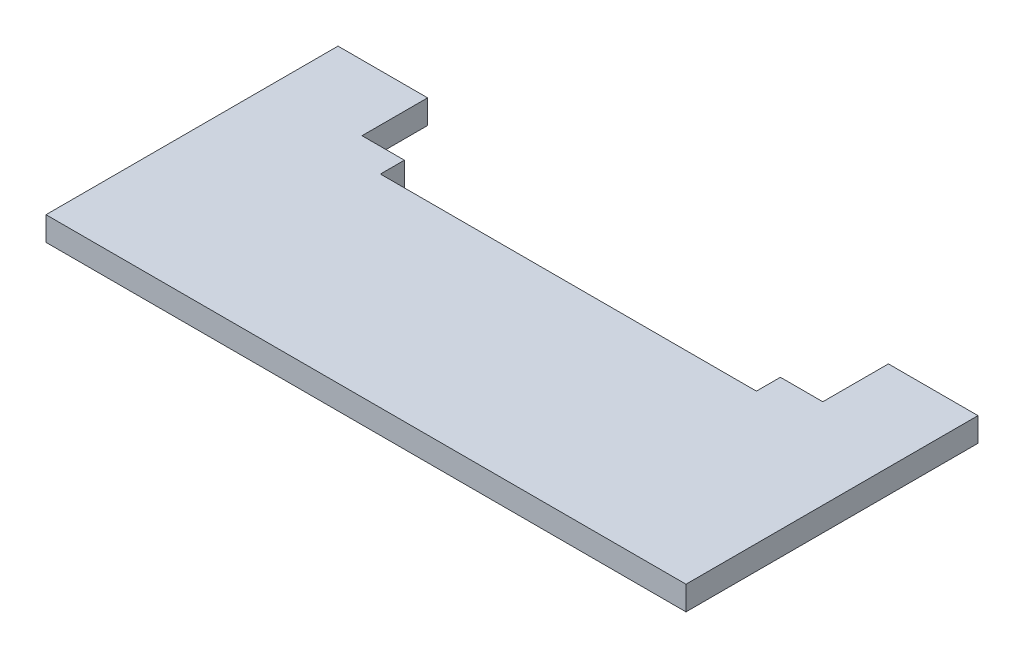
ISO-10303-21;
HEADER;
FILE_DESCRIPTION(('STEP AP214'),'2;1');
FILE_NAME('part.step','',(''),(''),'','','');
FILE_SCHEMA(('AUTOMOTIVE_DESIGN { 1 0 10303 214 1 1 1 1 }'));
ENDSEC;
DATA;
#1=APPLICATION_CONTEXT('core data for automotive mechanical design processes');
#2=APPLICATION_PROTOCOL_DEFINITION('international standard','automotive_design',2000,#1);
#3=PRODUCT_CONTEXT('',#1,'mechanical');
#4=PRODUCT('Part','Part','',(#3));
#5=PRODUCT_RELATED_PRODUCT_CATEGORY('part','',(#4));
#6=PRODUCT_DEFINITION_FORMATION('','',#4);
#7=PRODUCT_DEFINITION_CONTEXT('part definition',#1,'design');
#8=PRODUCT_DEFINITION('design','',#6,#7);
#9=PRODUCT_DEFINITION_SHAPE('','',#8);
#10=(LENGTH_UNIT() NAMED_UNIT(*) SI_UNIT(.MILLI.,.METRE.));
#11=(NAMED_UNIT(*) PLANE_ANGLE_UNIT() SI_UNIT($,.RADIAN.));
#12=(NAMED_UNIT(*) SI_UNIT($,.STERADIAN.) SOLID_ANGLE_UNIT());
#13=UNCERTAINTY_MEASURE_WITH_UNIT(LENGTH_MEASURE(1.E-05),#10,'distance_accuracy_value','');
#14=(GEOMETRIC_REPRESENTATION_CONTEXT(3) GLOBAL_UNCERTAINTY_ASSIGNED_CONTEXT((#13)) GLOBAL_UNIT_ASSIGNED_CONTEXT((#10,
#11,#12)) REPRESENTATION_CONTEXT('',''));
#15=CARTESIAN_POINT('',(0.,0.,0.));
#16=DIRECTION('',(0.,0.,1.));
#17=DIRECTION('',(1.,0.,0.));
#18=AXIS2_PLACEMENT_3D('',#15,#16,#17);
#19=CARTESIAN_POINT('',(11.2,-3.00000000000002,0.));
#20=DIRECTION('',(0.,0.,-1.));
#21=DIRECTION('',(-1.,0.,0.));
#22=AXIS2_PLACEMENT_3D('',#19,#20,#21);
#23=PLANE('',#22);
#24=DIRECTION('',(-1.,0.,0.));
#25=VECTOR('',#24,1.);
#26=CARTESIAN_POINT('',(11.2,0.,0.));
#27=LINE('',#26,#25);
#28=CARTESIAN_POINT('',(11.2,0.,0.));
#29=VERTEX_POINT('',#28);
#30=CARTESIAN_POINT('',(0.,0.,0.));
#31=VERTEX_POINT('',#30);
#32=EDGE_CURVE('E154',#29,#31,#27,.T.);
#33=ORIENTED_EDGE('',*,*,#32,.F.);
#34=DIRECTION('',(0.,1.,0.));
#35=VECTOR('',#34,1.);
#36=CARTESIAN_POINT('',(11.2,-3.00000000000002,0.));
#37=LINE('',#36,#35);
#38=CARTESIAN_POINT('',(11.2,-3.00000000000002,0.));
#39=VERTEX_POINT('',#38);
#40=EDGE_CURVE('E11',#39,#29,#37,.T.);
#41=ORIENTED_EDGE('',*,*,#40,.F.);
#42=DIRECTION('',(-1.,0.,0.));
#43=VECTOR('',#42,1.);
#44=CARTESIAN_POINT('',(11.2,-3.00000000000002,0.));
#45=LINE('',#44,#43);
#46=CARTESIAN_POINT('',(0.,-3.00000000000002,0.));
#47=VERTEX_POINT('',#46);
#48=EDGE_CURVE('E186',#39,#47,#45,.T.);
#49=ORIENTED_EDGE('',*,*,#48,.T.);
#50=DIRECTION('',(0.,1.,0.));
#51=VECTOR('',#50,1.);
#52=CARTESIAN_POINT('',(0.,-3.00000000000002,0.));
#53=LINE('',#52,#51);
#54=EDGE_CURVE('E36',#47,#31,#53,.T.);
#55=ORIENTED_EDGE('',*,*,#54,.T.);
#56=EDGE_LOOP('',(#33,#41,#49,#55));
#57=FACE_BOUND('',#56,.T.);
#58=ADVANCED_FACE('F33',(#57),#23,.T.);
#59=CARTESIAN_POINT('',(11.2,-3.00000000000002,0.));
#60=DIRECTION('',(1.,0.,0.));
#61=DIRECTION('',(0.,0.,-1.));
#62=AXIS2_PLACEMENT_3D('',#59,#60,#61);
#63=PLANE('',#62);
#64=DIRECTION('',(0.,0.,-1.));
#65=VECTOR('',#64,1.);
#66=CARTESIAN_POINT('',(11.2,0.,0.));
#67=LINE('',#66,#65);
#68=CARTESIAN_POINT('',(11.2,0.,8.19999999999996));
#69=VERTEX_POINT('',#68);
#70=EDGE_CURVE('E184',#69,#29,#67,.T.);
#71=ORIENTED_EDGE('',*,*,#70,.F.);
#72=DIRECTION('',(0.,1.,0.));
#73=VECTOR('',#72,1.);
#74=CARTESIAN_POINT('',(11.2,-3.00000000000002,8.19999999999996));
#75=LINE('',#74,#73);
#76=CARTESIAN_POINT('',(11.2,-3.00000000000002,8.19999999999996));
#77=VERTEX_POINT('',#76);
#78=EDGE_CURVE('E42',#77,#69,#75,.T.);
#79=ORIENTED_EDGE('',*,*,#78,.F.);
#80=DIRECTION('',(0.,0.,-1.));
#81=VECTOR('',#80,1.);
#82=CARTESIAN_POINT('',(11.2,-3.00000000000002,0.));
#83=LINE('',#82,#81);
#84=EDGE_CURVE('E144',#77,#39,#83,.T.);
#85=ORIENTED_EDGE('',*,*,#84,.T.);
#86=ORIENTED_EDGE('',*,*,#40,.T.);
#87=EDGE_LOOP('',(#71,#79,#85,#86));
#88=FACE_BOUND('',#87,.T.);
#89=ADVANCED_FACE('F206',(#88),#63,.T.);
#90=CARTESIAN_POINT('',(11.2,-3.00000000000002,8.19999999999996));
#91=DIRECTION('',(0.,0.,-1.));
#92=DIRECTION('',(-1.,0.,0.));
#93=AXIS2_PLACEMENT_3D('',#90,#91,#92);
#94=PLANE('',#93);
#95=DIRECTION('',(-1.,0.,0.));
#96=VECTOR('',#95,1.);
#97=CARTESIAN_POINT('',(11.2,0.,8.19999999999996));
#98=LINE('',#97,#96);
#99=CARTESIAN_POINT('',(16.5,0.,8.19999999999996));
#100=VERTEX_POINT('',#99);
#101=EDGE_CURVE('E131',#100,#69,#98,.T.);
#102=ORIENTED_EDGE('',*,*,#101,.F.);
#103=DIRECTION('',(0.,1.,0.));
#104=VECTOR('',#103,1.);
#105=CARTESIAN_POINT('',(16.5,-3.00000000000002,8.19999999999996));
#106=LINE('',#105,#104);
#107=CARTESIAN_POINT('',(16.5,-3.00000000000002,8.19999999999996));
#108=VERTEX_POINT('',#107);
#109=EDGE_CURVE('E126',#108,#100,#106,.T.);
#110=ORIENTED_EDGE('',*,*,#109,.F.);
#111=DIRECTION('',(-1.,0.,0.));
#112=VECTOR('',#111,1.);
#113=CARTESIAN_POINT('',(11.2,-3.00000000000002,8.19999999999996));
#114=LINE('',#113,#112);
#115=EDGE_CURVE('E129',#108,#77,#114,.T.);
#116=ORIENTED_EDGE('',*,*,#115,.T.);
#117=ORIENTED_EDGE('',*,*,#78,.T.);
#118=EDGE_LOOP('',(#102,#110,#116,#117));
#119=FACE_BOUND('',#118,.T.);
#120=ADVANCED_FACE('F128',(#119),#94,.T.);
#121=CARTESIAN_POINT('',(16.5,-3.00000000000002,8.19999999999996));
#122=DIRECTION('',(1.,0.,0.));
#123=DIRECTION('',(0.,0.,-1.));
#124=AXIS2_PLACEMENT_3D('',#121,#122,#123);
#125=PLANE('',#124);
#126=DIRECTION('',(0.,0.,-1.));
#127=VECTOR('',#126,1.);
#128=CARTESIAN_POINT('',(16.5,0.,8.19999999999996));
#129=LINE('',#128,#127);
#130=CARTESIAN_POINT('',(16.5,0.,11.2));
#131=VERTEX_POINT('',#130);
#132=EDGE_CURVE('E181',#131,#100,#129,.T.);
#133=ORIENTED_EDGE('',*,*,#132,.F.);
#134=DIRECTION('',(0.,1.,0.));
#135=VECTOR('',#134,1.);
#136=CARTESIAN_POINT('',(16.5,-3.00000000000002,11.2));
#137=LINE('',#136,#135);
#138=CARTESIAN_POINT('',(16.5,-3.00000000000002,11.2));
#139=VERTEX_POINT('',#138);
#140=EDGE_CURVE('E136',#139,#131,#137,.T.);
#141=ORIENTED_EDGE('',*,*,#140,.F.);
#142=DIRECTION('',(0.,0.,-1.));
#143=VECTOR('',#142,1.);
#144=CARTESIAN_POINT('',(16.5,-3.00000000000002,8.19999999999996));
#145=LINE('',#144,#143);
#146=EDGE_CURVE('E142',#139,#108,#145,.T.);
#147=ORIENTED_EDGE('',*,*,#146,.T.);
#148=ORIENTED_EDGE('',*,*,#109,.T.);
#149=EDGE_LOOP('',(#133,#141,#147,#148));
#150=FACE_BOUND('',#149,.T.);
#151=ADVANCED_FACE('F146',(#150),#125,.T.);
#152=CARTESIAN_POINT('',(63.5,-3.00000000000002,11.2));
#153=DIRECTION('',(0.,0.,-1.));
#154=DIRECTION('',(-1.,0.,0.));
#155=AXIS2_PLACEMENT_3D('',#152,#153,#154);
#156=PLANE('',#155);
#157=DIRECTION('',(-1.,0.,0.));
#158=VECTOR('',#157,1.);
#159=CARTESIAN_POINT('',(63.5,0.,11.2));
#160=LINE('',#159,#158);
#161=CARTESIAN_POINT('',(63.5,0.,11.2));
#162=VERTEX_POINT('',#161);
#163=EDGE_CURVE('E178',#162,#131,#160,.T.);
#164=ORIENTED_EDGE('',*,*,#163,.F.);
#165=DIRECTION('',(0.,1.,0.));
#166=VECTOR('',#165,1.);
#167=CARTESIAN_POINT('',(63.5,-3.00000000000002,11.2));
#168=LINE('',#167,#166);
#169=CARTESIAN_POINT('',(63.5,-3.00000000000002,11.2));
#170=VERTEX_POINT('',#169);
#171=EDGE_CURVE('E190',#170,#162,#168,.T.);
#172=ORIENTED_EDGE('',*,*,#171,.F.);
#173=DIRECTION('',(-1.,0.,0.));
#174=VECTOR('',#173,1.);
#175=CARTESIAN_POINT('',(63.5,-3.00000000000002,11.2));
#176=LINE('',#175,#174);
#177=EDGE_CURVE('E147',#170,#139,#176,.T.);
#178=ORIENTED_EDGE('',*,*,#177,.T.);
#179=ORIENTED_EDGE('',*,*,#140,.T.);
#180=EDGE_LOOP('',(#164,#172,#178,#179));
#181=FACE_BOUND('',#180,.T.);
#182=ADVANCED_FACE('F219',(#181),#156,.T.);
#183=CARTESIAN_POINT('',(63.5,-3.00000000000002,8.19999999999996));
#184=DIRECTION('',(-1.,0.,0.));
#185=DIRECTION('',(0.,0.,1.));
#186=AXIS2_PLACEMENT_3D('',#183,#184,#185);
#187=PLANE('',#186);
#188=DIRECTION('',(0.,0.,1.));
#189=VECTOR('',#188,1.);
#190=CARTESIAN_POINT('',(63.5,0.,8.19999999999996));
#191=LINE('',#190,#189);
#192=CARTESIAN_POINT('',(63.5,0.,8.19999999999996));
#193=VERTEX_POINT('',#192);
#194=EDGE_CURVE('E175',#193,#162,#191,.T.);
#195=ORIENTED_EDGE('',*,*,#194,.F.);
#196=DIRECTION('',(0.,1.,0.));
#197=VECTOR('',#196,1.);
#198=CARTESIAN_POINT('',(63.5,-3.00000000000002,8.19999999999996));
#199=LINE('',#198,#197);
#200=CARTESIAN_POINT('',(63.5,-3.00000000000002,8.19999999999996));
#201=VERTEX_POINT('',#200);
#202=EDGE_CURVE('E192',#201,#193,#199,.T.);
#203=ORIENTED_EDGE('',*,*,#202,.F.);
#204=DIRECTION('',(0.,0.,1.));
#205=VECTOR('',#204,1.);
#206=CARTESIAN_POINT('',(63.5,-3.00000000000002,8.19999999999996));
#207=LINE('',#206,#205);
#208=EDGE_CURVE('E149',#201,#170,#207,.T.);
#209=ORIENTED_EDGE('',*,*,#208,.T.);
#210=ORIENTED_EDGE('',*,*,#171,.T.);
#211=EDGE_LOOP('',(#195,#203,#209,#210));
#212=FACE_BOUND('',#211,.T.);
#213=ADVANCED_FACE('F222',(#212),#187,.T.);
#214=CARTESIAN_POINT('',(68.8,-3.00000000000002,8.19999999999996));
#215=DIRECTION('',(0.,0.,-1.));
#216=DIRECTION('',(-1.,0.,0.));
#217=AXIS2_PLACEMENT_3D('',#214,#215,#216);
#218=PLANE('',#217);
#219=DIRECTION('',(-1.,0.,0.));
#220=VECTOR('',#219,1.);
#221=CARTESIAN_POINT('',(68.8,0.,8.19999999999996));
#222=LINE('',#221,#220);
#223=CARTESIAN_POINT('',(68.8,0.,8.19999999999996));
#224=VERTEX_POINT('',#223);
#225=EDGE_CURVE('E172',#224,#193,#222,.T.);
#226=ORIENTED_EDGE('',*,*,#225,.F.);
#227=DIRECTION('',(0.,1.,0.));
#228=VECTOR('',#227,1.);
#229=CARTESIAN_POINT('',(68.8,-3.00000000000002,8.19999999999996));
#230=LINE('',#229,#228);
#231=CARTESIAN_POINT('',(68.8,-3.00000000000002,8.19999999999996));
#232=VERTEX_POINT('',#231);
#233=EDGE_CURVE('E194',#232,#224,#230,.T.);
#234=ORIENTED_EDGE('',*,*,#233,.F.);
#235=DIRECTION('',(-1.,0.,0.));
#236=VECTOR('',#235,1.);
#237=CARTESIAN_POINT('',(68.8,-3.00000000000002,8.19999999999996));
#238=LINE('',#237,#236);
#239=EDGE_CURVE('E348',#232,#201,#238,.T.);
#240=ORIENTED_EDGE('',*,*,#239,.T.);
#241=ORIENTED_EDGE('',*,*,#202,.T.);
#242=EDGE_LOOP('',(#226,#234,#240,#241));
#243=FACE_BOUND('',#242,.T.);
#244=ADVANCED_FACE('F226',(#243),#218,.T.);
#245=CARTESIAN_POINT('',(68.8,-3.00000000000002,0.));
#246=DIRECTION('',(-1.,0.,0.));
#247=DIRECTION('',(0.,0.,1.));
#248=AXIS2_PLACEMENT_3D('',#245,#246,#247);
#249=PLANE('',#248);
#250=DIRECTION('',(0.,0.,1.));
#251=VECTOR('',#250,1.);
#252=CARTESIAN_POINT('',(68.8,0.,0.));
#253=LINE('',#252,#251);
#254=CARTESIAN_POINT('',(68.8,0.,0.));
#255=VERTEX_POINT('',#254);
#256=EDGE_CURVE('E169',#255,#224,#253,.T.);
#257=ORIENTED_EDGE('',*,*,#256,.F.);
#258=DIRECTION('',(0.,1.,0.));
#259=VECTOR('',#258,1.);
#260=CARTESIAN_POINT('',(68.8,-3.00000000000002,0.));
#261=LINE('',#260,#259);
#262=CARTESIAN_POINT('',(68.8,-3.00000000000002,0.));
#263=VERTEX_POINT('',#262);
#264=EDGE_CURVE('E196',#263,#255,#261,.T.);
#265=ORIENTED_EDGE('',*,*,#264,.F.);
#266=DIRECTION('',(0.,0.,1.));
#267=VECTOR('',#266,1.);
#268=CARTESIAN_POINT('',(68.8,-3.00000000000002,0.));
#269=LINE('',#268,#267);
#270=EDGE_CURVE('E352',#263,#232,#269,.T.);
#271=ORIENTED_EDGE('',*,*,#270,.T.);
#272=ORIENTED_EDGE('',*,*,#233,.T.);
#273=EDGE_LOOP('',(#257,#265,#271,#272));
#274=FACE_BOUND('',#273,.T.);
#275=ADVANCED_FACE('F230',(#274),#249,.T.);
#276=CARTESIAN_POINT('',(80.,-3.00000000000002,0.));
#277=DIRECTION('',(0.,0.,-1.));
#278=DIRECTION('',(-1.,0.,0.));
#279=AXIS2_PLACEMENT_3D('',#276,#277,#278);
#280=PLANE('',#279);
#281=DIRECTION('',(-1.,0.,0.));
#282=VECTOR('',#281,1.);
#283=CARTESIAN_POINT('',(80.,0.,0.));
#284=LINE('',#283,#282);
#285=CARTESIAN_POINT('',(80.,0.,0.));
#286=VERTEX_POINT('',#285);
#287=EDGE_CURVE('E166',#286,#255,#284,.T.);
#288=ORIENTED_EDGE('',*,*,#287,.F.);
#289=DIRECTION('',(0.,1.,0.));
#290=VECTOR('',#289,1.);
#291=CARTESIAN_POINT('',(80.,-3.00000000000002,0.));
#292=LINE('',#291,#290);
#293=CARTESIAN_POINT('',(80.,-3.00000000000002,0.));
#294=VERTEX_POINT('',#293);
#295=EDGE_CURVE('E198',#294,#286,#292,.T.);
#296=ORIENTED_EDGE('',*,*,#295,.F.);
#297=DIRECTION('',(-1.,0.,0.));
#298=VECTOR('',#297,1.);
#299=CARTESIAN_POINT('',(80.,-3.00000000000002,0.));
#300=LINE('',#299,#298);
#301=EDGE_CURVE('E341',#294,#263,#300,.T.);
#302=ORIENTED_EDGE('',*,*,#301,.T.);
#303=ORIENTED_EDGE('',*,*,#264,.T.);
#304=EDGE_LOOP('',(#288,#296,#302,#303));
#305=FACE_BOUND('',#304,.T.);
#306=ADVANCED_FACE('F234',(#305),#280,.T.);
#307=CARTESIAN_POINT('',(80.,-3.00000000000002,0.));
#308=DIRECTION('',(1.,0.,0.));
#309=DIRECTION('',(0.,0.,-1.));
#310=AXIS2_PLACEMENT_3D('',#307,#308,#309);
#311=PLANE('',#310);
#312=DIRECTION('',(0.,0.,-1.));
#313=VECTOR('',#312,1.);
#314=CARTESIAN_POINT('',(80.,0.,0.));
#315=LINE('',#314,#313);
#316=CARTESIAN_POINT('',(80.,0.,36.5));
#317=VERTEX_POINT('',#316);
#318=EDGE_CURVE('E163',#317,#286,#315,.T.);
#319=ORIENTED_EDGE('',*,*,#318,.F.);
#320=DIRECTION('',(0.,1.,0.));
#321=VECTOR('',#320,1.);
#322=CARTESIAN_POINT('',(80.,-3.00000000000002,36.5));
#323=LINE('',#322,#321);
#324=CARTESIAN_POINT('',(80.,-3.00000000000002,36.5));
#325=VERTEX_POINT('',#324);
#326=EDGE_CURVE('E200',#325,#317,#323,.T.);
#327=ORIENTED_EDGE('',*,*,#326,.F.);
#328=DIRECTION('',(0.,0.,-1.));
#329=VECTOR('',#328,1.);
#330=CARTESIAN_POINT('',(80.,-3.00000000000002,0.));
#331=LINE('',#330,#329);
#332=EDGE_CURVE('E337',#325,#294,#331,.T.);
#333=ORIENTED_EDGE('',*,*,#332,.T.);
#334=ORIENTED_EDGE('',*,*,#295,.T.);
#335=EDGE_LOOP('',(#319,#327,#333,#334));
#336=FACE_BOUND('',#335,.T.);
#337=ADVANCED_FACE('F238',(#336),#311,.T.);
#338=CARTESIAN_POINT('',(0.,-3.00000000000002,36.5));
#339=DIRECTION('',(0.,0.,1.));
#340=DIRECTION('',(1.,0.,0.));
#341=AXIS2_PLACEMENT_3D('',#338,#339,#340);
#342=PLANE('',#341);
#343=DIRECTION('',(1.,0.,0.));
#344=VECTOR('',#343,1.);
#345=CARTESIAN_POINT('',(0.,0.,36.5));
#346=LINE('',#345,#344);
#347=CARTESIAN_POINT('',(0.,0.,36.5));
#348=VERTEX_POINT('',#347);
#349=EDGE_CURVE('E160',#348,#317,#346,.T.);
#350=ORIENTED_EDGE('',*,*,#349,.F.);
#351=DIRECTION('',(0.,1.,0.));
#352=VECTOR('',#351,1.);
#353=CARTESIAN_POINT('',(0.,-3.00000000000002,36.5));
#354=LINE('',#353,#352);
#355=CARTESIAN_POINT('',(0.,-3.00000000000002,36.5));
#356=VERTEX_POINT('',#355);
#357=EDGE_CURVE('E201',#356,#348,#354,.T.);
#358=ORIENTED_EDGE('',*,*,#357,.F.);
#359=DIRECTION('',(1.,0.,0.));
#360=VECTOR('',#359,1.);
#361=CARTESIAN_POINT('',(0.,-3.00000000000002,36.5));
#362=LINE('',#361,#360);
#363=EDGE_CURVE('E358',#356,#325,#362,.T.);
#364=ORIENTED_EDGE('',*,*,#363,.T.);
#365=ORIENTED_EDGE('',*,*,#326,.T.);
#366=EDGE_LOOP('',(#350,#358,#364,#365));
#367=FACE_BOUND('',#366,.T.);
#368=ADVANCED_FACE('F242',(#367),#342,.T.);
#369=CARTESIAN_POINT('',(0.,-3.00000000000002,0.));
#370=DIRECTION('',(-1.,0.,0.));
#371=DIRECTION('',(0.,0.,1.));
#372=AXIS2_PLACEMENT_3D('',#369,#370,#371);
#373=PLANE('',#372);
#374=DIRECTION('',(0.,0.,1.));
#375=VECTOR('',#374,1.);
#376=CARTESIAN_POINT('',(0.,0.,0.));
#377=LINE('',#376,#375);
#378=EDGE_CURVE('E157',#31,#348,#377,.T.);
#379=ORIENTED_EDGE('',*,*,#378,.F.);
#380=ORIENTED_EDGE('',*,*,#54,.F.);
#381=DIRECTION('',(0.,0.,1.));
#382=VECTOR('',#381,1.);
#383=CARTESIAN_POINT('',(0.,-3.00000000000002,0.));
#384=LINE('',#383,#382);
#385=EDGE_CURVE('E360',#47,#356,#384,.T.);
#386=ORIENTED_EDGE('',*,*,#385,.T.);
#387=ORIENTED_EDGE('',*,*,#357,.T.);
#388=EDGE_LOOP('',(#379,#380,#386,#387));
#389=FACE_BOUND('',#388,.T.);
#390=ADVANCED_FACE('F203',(#389),#373,.T.);
#391=CARTESIAN_POINT('',(0.,-3.00000000000002,0.));
#392=DIRECTION('',(0.,1.,0.));
#393=DIRECTION('',(0.,0.,1.));
#394=AXIS2_PLACEMENT_3D('',#391,#392,#393);
#395=PLANE('',#394);
#396=ORIENTED_EDGE('',*,*,#48,.F.);
#397=ORIENTED_EDGE('',*,*,#84,.F.);
#398=ORIENTED_EDGE('',*,*,#115,.F.);
#399=ORIENTED_EDGE('',*,*,#146,.F.);
#400=ORIENTED_EDGE('',*,*,#177,.F.);
#401=ORIENTED_EDGE('',*,*,#208,.F.);
#402=ORIENTED_EDGE('',*,*,#239,.F.);
#403=ORIENTED_EDGE('',*,*,#270,.F.);
#404=ORIENTED_EDGE('',*,*,#301,.F.);
#405=ORIENTED_EDGE('',*,*,#332,.F.);
#406=ORIENTED_EDGE('',*,*,#363,.F.);
#407=ORIENTED_EDGE('',*,*,#385,.F.);
#408=EDGE_LOOP('',(#396,#397,#398,#399,#400,#401,#402,#403,#404,#405,#406,#407));
#409=FACE_BOUND('',#408,.T.);
#410=ADVANCED_FACE('F140',(#409),#395,.F.);
#411=CARTESIAN_POINT('',(0.,0.,0.));
#412=DIRECTION('',(0.,1.,0.));
#413=DIRECTION('',(0.,0.,1.));
#414=AXIS2_PLACEMENT_3D('',#411,#412,#413);
#415=PLANE('',#414);
#416=ORIENTED_EDGE('',*,*,#32,.T.);
#417=ORIENTED_EDGE('',*,*,#378,.T.);
#418=ORIENTED_EDGE('',*,*,#349,.T.);
#419=ORIENTED_EDGE('',*,*,#318,.T.);
#420=ORIENTED_EDGE('',*,*,#287,.T.);
#421=ORIENTED_EDGE('',*,*,#256,.T.);
#422=ORIENTED_EDGE('',*,*,#225,.T.);
#423=ORIENTED_EDGE('',*,*,#194,.T.);
#424=ORIENTED_EDGE('',*,*,#163,.T.);
#425=ORIENTED_EDGE('',*,*,#132,.T.);
#426=ORIENTED_EDGE('',*,*,#101,.T.);
#427=ORIENTED_EDGE('',*,*,#70,.T.);
#428=EDGE_LOOP('',(#416,#417,#418,#419,#420,#421,#422,#423,#424,#425,#426,#427));
#429=FACE_BOUND('',#428,.T.);
#430=ADVANCED_FACE('F205',(#429),#415,.T.);
#431=CLOSED_SHELL('',(#58,#89,#120,#151,#182,#213,#244,#275,#306,#337,#368,#390,#410,#430));
#432=MANIFOLD_SOLID_BREP('B2',#431);
#433=ADVANCED_BREP_SHAPE_REPRESENTATION('',(#18,#432),#14);
#434=SHAPE_DEFINITION_REPRESENTATION(#9,#433);
ENDSEC;
END-ISO-10303-21;
